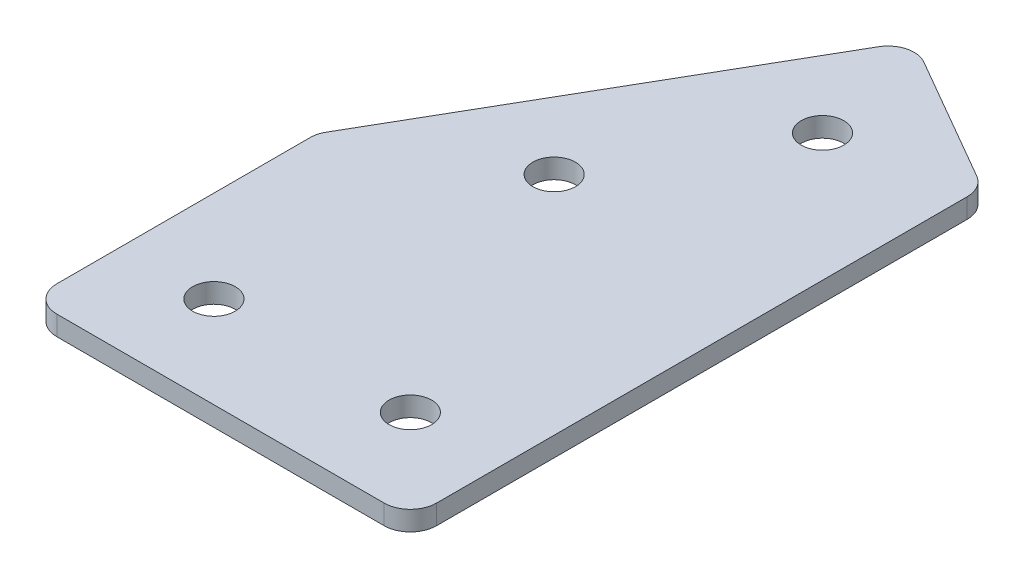
ISO-10303-21;
HEADER;
FILE_DESCRIPTION(('STEP AP214'),'2;1');
FILE_NAME('part.step','',(''),(''),'','','');
FILE_SCHEMA(('AUTOMOTIVE_DESIGN { 1 0 10303 214 1 1 1 1 }'));
ENDSEC;
DATA;
#1=APPLICATION_CONTEXT('core data for automotive mechanical design processes');
#2=APPLICATION_PROTOCOL_DEFINITION('international standard','automotive_design',2000,#1);
#3=PRODUCT_CONTEXT('',#1,'mechanical');
#4=PRODUCT('Part','Part','',(#3));
#5=PRODUCT_RELATED_PRODUCT_CATEGORY('part','',(#4));
#6=PRODUCT_DEFINITION_FORMATION('','',#4);
#7=PRODUCT_DEFINITION_CONTEXT('part definition',#1,'design');
#8=PRODUCT_DEFINITION('design','',#6,#7);
#9=PRODUCT_DEFINITION_SHAPE('','',#8);
#10=(LENGTH_UNIT() NAMED_UNIT(*) SI_UNIT(.MILLI.,.METRE.));
#11=(NAMED_UNIT(*) PLANE_ANGLE_UNIT() SI_UNIT($,.RADIAN.));
#12=(NAMED_UNIT(*) SI_UNIT($,.STERADIAN.) SOLID_ANGLE_UNIT());
#13=UNCERTAINTY_MEASURE_WITH_UNIT(LENGTH_MEASURE(1.E-05),#10,'distance_accuracy_value','');
#14=(GEOMETRIC_REPRESENTATION_CONTEXT(3) GLOBAL_UNCERTAINTY_ASSIGNED_CONTEXT((#13)) GLOBAL_UNIT_ASSIGNED_CONTEXT((#10,
#11,#12)) REPRESENTATION_CONTEXT('',''));
#15=CARTESIAN_POINT('',(0.,0.,0.));
#16=DIRECTION('',(0.,0.,1.));
#17=DIRECTION('',(1.,0.,0.));
#18=AXIS2_PLACEMENT_3D('',#15,#16,#17);
#19=CARTESIAN_POINT('',(-17.0163268204157,1.95798729371791,17.3320099734962));
#20=DIRECTION('',(0.,1.,0.));
#21=DIRECTION('',(0.,0.,1.));
#22=AXIS2_PLACEMENT_3D('',#19,#20,#21);
#23=PLANE('',#22);
#24=CARTESIAN_POINT('',(5.48367317958992,1.95798729371791,17.3320099734962));
#25=DIRECTION('',(0.,1.,0.));
#26=DIRECTION('',(0.,0.,1.));
#27=AXIS2_PLACEMENT_3D('',#24,#25,#26);
#28=CIRCLE('',#27,1.625);
#29=CARTESIAN_POINT('',(5.48367317958992,1.95798729371791,18.9570099734962));
#30=VERTEX_POINT('',#29);
#31=EDGE_CURVE('E201',#30,#30,#28,.T.);
#32=ORIENTED_EDGE('',*,*,#31,.T.);
#33=EDGE_LOOP('',(#32));
#34=FACE_BOUND('',#33,.T.);
#35=CARTESIAN_POINT('',(2.73848265120657,1.95798729371791,-16.8843237251865));
#36=DIRECTION('',(0.,1.,0.));
#37=DIRECTION('',(0.,0.,1.));
#38=AXIS2_PLACEMENT_3D('',#35,#36,#37);
#39=CIRCLE('',#38,1.625);
#40=CARTESIAN_POINT('',(2.73848265120657,1.95798729371791,-15.2593237251865));
#41=VERTEX_POINT('',#40);
#42=EDGE_CURVE('E195',#41,#41,#39,.T.);
#43=ORIENTED_EDGE('',*,*,#42,.T.);
#44=EDGE_LOOP('',(#43));
#45=FACE_BOUND('',#44,.T.);
#46=CARTESIAN_POINT('',(-4.76151734879343,1.95798729371791,-3.89394266841995));
#47=DIRECTION('',(0.,1.,0.));
#48=DIRECTION('',(0.,0.,1.));
#49=AXIS2_PLACEMENT_3D('',#46,#47,#48);
#50=CIRCLE('',#49,1.62500000000001);
#51=CARTESIAN_POINT('',(-4.76151734879343,1.95798729371791,-2.26894266841994));
#52=VERTEX_POINT('',#51);
#53=EDGE_CURVE('E189',#52,#52,#50,.T.);
#54=ORIENTED_EDGE('',*,*,#53,.T.);
#55=EDGE_LOOP('',(#54));
#56=FACE_BOUND('',#55,.T.);
#57=CARTESIAN_POINT('',(-9.51632682041008,1.95798729371791,17.3320099734962));
#58=DIRECTION('',(0.,1.,0.));
#59=DIRECTION('',(0.,0.,1.));
#60=AXIS2_PLACEMENT_3D('',#57,#58,#59);
#61=CIRCLE('',#60,1.625);
#62=CARTESIAN_POINT('',(-9.51632682041008,1.95798729371791,18.9570099734962));
#63=VERTEX_POINT('',#62);
#64=EDGE_CURVE('E115',#63,#63,#61,.T.);
#65=ORIENTED_EDGE('',*,*,#64,.T.);
#66=EDGE_LOOP('',(#65));
#67=FACE_BOUND('',#66,.T.);
#68=DIRECTION('',(0.,0.,1.));
#69=VECTOR('',#68,1.);
#70=CARTESIAN_POINT('',(-16.5163268204101,1.95798729371791,2.46598456971151));
#71=LINE('',#70,#69);
#72=CARTESIAN_POINT('',(-16.5163268204101,1.95798729371791,3.00188295457375));
#73=VERTEX_POINT('',#72);
#74=CARTESIAN_POINT('',(-16.5163268204101,1.95798729371791,22.3320099734963));
#75=VERTEX_POINT('',#74);
#76=EDGE_CURVE('E182',#73,#75,#71,.T.);
#77=ORIENTED_EDGE('',*,*,#76,.F.);
#78=CARTESIAN_POINT('',(-14.5163268204101,1.95798729371791,3.00188295457375));
#79=DIRECTION('',(0.,1.,0.));
#80=DIRECTION('',(0.,0.,1.));
#81=AXIS2_PLACEMENT_3D('',#78,#79,#80);
#82=CIRCLE('',#81,2.);
#83=CARTESIAN_POINT('',(-16.248377627979,1.95798729371791,2.00188295457376));
#84=VERTEX_POINT('',#83);
#85=EDGE_CURVE('E146',#73,#84,#82,.F.);
#86=ORIENTED_EDGE('',*,*,#85,.T.);
#87=DIRECTION('',(-0.500000000000001,0.,0.866025403784438));
#88=VECTOR('',#87,1.);
#89=CARTESIAN_POINT('',(0.176304824715319,1.95798729371791,-26.4465015516776));
#90=LINE('',#89,#88);
#91=CARTESIAN_POINT('',(-0.823695175284678,1.95798729371791,-24.7144507441088));
#92=VERTEX_POINT('',#91);
#93=EDGE_CURVE('E174',#92,#84,#90,.T.);
#94=ORIENTED_EDGE('',*,*,#93,.F.);
#95=CARTESIAN_POINT('',(0.908355632284197,1.95798729371791,-23.7144507441088));
#96=DIRECTION('',(0.,1.,0.));
#97=DIRECTION('',(0.,0.,1.));
#98=AXIS2_PLACEMENT_3D('',#95,#96,#97);
#99=CIRCLE('',#98,2.);
#100=CARTESIAN_POINT('',(1.90835563228419,1.95798729371791,-25.4465015516777));
#101=VERTEX_POINT('',#100);
#102=EDGE_CURVE('E118',#92,#101,#99,.F.);
#103=ORIENTED_EDGE('',*,*,#102,.T.);
#104=DIRECTION('',(-0.86602540378444,0.,-0.499999999999997));
#105=VECTOR('',#104,1.);
#106=CARTESIAN_POINT('',(12.4836731795899,1.95798729371791,-19.340839118975));
#107=LINE('',#106,#105);
#108=CARTESIAN_POINT('',(11.4836731795899,1.95798729371791,-19.9181893881646));
#109=VERTEX_POINT('',#108);
#110=EDGE_CURVE('E119',#109,#101,#107,.T.);
#111=ORIENTED_EDGE('',*,*,#110,.F.);
#112=CARTESIAN_POINT('',(10.4836731795899,1.95798729371791,-18.1861385805957));
#113=DIRECTION('',(0.,1.,0.));
#114=DIRECTION('',(0.,0.,1.));
#115=AXIS2_PLACEMENT_3D('',#112,#113,#114);
#116=CIRCLE('',#115,2.);
#117=CARTESIAN_POINT('',(12.4836731795899,1.95798729371791,-18.1861385805957));
#118=VERTEX_POINT('',#117);
#119=EDGE_CURVE('E141',#109,#118,#116,.F.);
#120=ORIENTED_EDGE('',*,*,#119,.T.);
#121=DIRECTION('',(0.,0.,-1.));
#122=VECTOR('',#121,1.);
#123=CARTESIAN_POINT('',(12.4836731795899,1.95798729371791,24.3320099734963));
#124=LINE('',#123,#122);
#125=CARTESIAN_POINT('',(12.4836731795899,1.95798729371791,22.3320099734963));
#126=VERTEX_POINT('',#125);
#127=EDGE_CURVE('E123',#126,#118,#124,.T.);
#128=ORIENTED_EDGE('',*,*,#127,.F.);
#129=CARTESIAN_POINT('',(10.4836731795899,1.95798729371791,22.3320099734963));
#130=DIRECTION('',(0.,1.,0.));
#131=DIRECTION('',(0.,0.,1.));
#132=AXIS2_PLACEMENT_3D('',#129,#130,#131);
#133=CIRCLE('',#132,2.);
#134=CARTESIAN_POINT('',(10.4836731795899,1.95798729371791,24.3320099734963));
#135=VERTEX_POINT('',#134);
#136=EDGE_CURVE('E31',#126,#135,#133,.F.);
#137=ORIENTED_EDGE('',*,*,#136,.T.);
#138=DIRECTION('',(1.,0.,0.));
#139=VECTOR('',#138,1.);
#140=CARTESIAN_POINT('',(-16.5163268204101,1.95798729371791,24.3320099734963));
#141=LINE('',#140,#139);
#142=CARTESIAN_POINT('',(-14.5163268204101,1.95798729371791,24.3320099734963));
#143=VERTEX_POINT('',#142);
#144=EDGE_CURVE('E180',#143,#135,#141,.T.);
#145=ORIENTED_EDGE('',*,*,#144,.F.);
#146=CARTESIAN_POINT('',(-14.5163268204101,1.95798729371791,22.3320099734963));
#147=DIRECTION('',(0.,1.,0.));
#148=DIRECTION('',(0.,0.,1.));
#149=AXIS2_PLACEMENT_3D('',#146,#147,#148);
#150=CIRCLE('',#149,2.);
#151=EDGE_CURVE('E144',#143,#75,#150,.F.);
#152=ORIENTED_EDGE('',*,*,#151,.T.);
#153=EDGE_LOOP('',(#77,#86,#94,#103,#111,#120,#128,#137,#145,#152));
#154=FACE_BOUND('',#153,.T.);
#155=ADVANCED_FACE('F16',(#34,#45,#56,#67,#154),#23,.F.);
#156=CARTESIAN_POINT('',(0.176304824715319,1.95798729371791,-26.4465015516776));
#157=DIRECTION('',(-0.866025403784438,0.,-0.500000000000001));
#158=DIRECTION('',(-0.500000000000001,0.,0.866025403784438));
#159=AXIS2_PLACEMENT_3D('',#156,#157,#158);
#160=PLANE('',#159);
#161=ORIENTED_EDGE('',*,*,#93,.T.);
#162=DIRECTION('',(0.,1.,0.));
#163=VECTOR('',#162,1.);
#164=CARTESIAN_POINT('',(-16.248377627979,1.95798729371791,2.00188295457375));
#165=LINE('',#164,#163);
#166=CARTESIAN_POINT('',(-16.248377627979,3.45798729371791,2.00188295457376));
#167=VERTEX_POINT('',#166);
#168=EDGE_CURVE('E105',#84,#167,#165,.T.);
#169=ORIENTED_EDGE('',*,*,#168,.T.);
#170=DIRECTION('',(-0.500000000000001,0.,0.866025403784438));
#171=VECTOR('',#170,1.);
#172=CARTESIAN_POINT('',(0.176304824715319,3.45798729371791,-26.4465015516776));
#173=LINE('',#172,#171);
#174=CARTESIAN_POINT('',(-0.823695175284678,3.45798729371791,-24.7144507441088));
#175=VERTEX_POINT('',#174);
#176=EDGE_CURVE('E97',#175,#167,#173,.T.);
#177=ORIENTED_EDGE('',*,*,#176,.F.);
#178=DIRECTION('',(0.,1.,0.));
#179=VECTOR('',#178,1.);
#180=CARTESIAN_POINT('',(-0.823695175284678,1.95798729371791,-24.7144507441088));
#181=LINE('',#180,#179);
#182=EDGE_CURVE('E111',#175,#92,#181,.F.);
#183=ORIENTED_EDGE('',*,*,#182,.T.);
#184=EDGE_LOOP('',(#161,#169,#177,#183));
#185=FACE_BOUND('',#184,.T.);
#186=ADVANCED_FACE('F110',(#185),#160,.T.);
#187=CARTESIAN_POINT('',(12.4836731795899,1.95798729371791,-19.340839118975));
#188=DIRECTION('',(0.499999999999997,0.,-0.866025403784441));
#189=DIRECTION('',(-0.866025403784441,0.,-0.499999999999997));
#190=AXIS2_PLACEMENT_3D('',#187,#188,#189);
#191=PLANE('',#190);
#192=DIRECTION('',(-0.86602540378444,0.,-0.499999999999997));
#193=VECTOR('',#192,1.);
#194=CARTESIAN_POINT('',(12.4836731795899,3.45798729371791,-19.340839118975));
#195=LINE('',#194,#193);
#196=CARTESIAN_POINT('',(11.4836731795899,3.45798729371791,-19.9181893881646));
#197=VERTEX_POINT('',#196);
#198=CARTESIAN_POINT('',(1.90835563228419,3.45798729371791,-25.4465015516777));
#199=VERTEX_POINT('',#198);
#200=EDGE_CURVE('E99',#197,#199,#195,.T.);
#201=ORIENTED_EDGE('',*,*,#200,.F.);
#202=DIRECTION('',(0.,1.,0.));
#203=VECTOR('',#202,1.);
#204=CARTESIAN_POINT('',(11.4836731795899,1.95798729371791,-19.9181893881646));
#205=LINE('',#204,#203);
#206=EDGE_CURVE('E10',#197,#109,#205,.F.);
#207=ORIENTED_EDGE('',*,*,#206,.T.);
#208=ORIENTED_EDGE('',*,*,#110,.T.);
#209=DIRECTION('',(0.,1.,0.));
#210=VECTOR('',#209,1.);
#211=CARTESIAN_POINT('',(1.90835563228419,1.95798729371791,-25.4465015516777));
#212=LINE('',#211,#210);
#213=EDGE_CURVE('E24',#101,#199,#212,.T.);
#214=ORIENTED_EDGE('',*,*,#213,.T.);
#215=EDGE_LOOP('',(#201,#207,#208,#214));
#216=FACE_BOUND('',#215,.T.);
#217=ADVANCED_FACE('F157',(#216),#191,.T.);
#218=CARTESIAN_POINT('',(12.4836731795899,1.95798729371791,24.3320099734963));
#219=DIRECTION('',(1.,0.,0.));
#220=DIRECTION('',(0.,0.,-1.));
#221=AXIS2_PLACEMENT_3D('',#218,#219,#220);
#222=PLANE('',#221);
#223=DIRECTION('',(0.,0.,-1.));
#224=VECTOR('',#223,1.);
#225=CARTESIAN_POINT('',(12.4836731795899,3.45798729371791,24.3320099734963));
#226=LINE('',#225,#224);
#227=CARTESIAN_POINT('',(12.4836731795899,3.45798729371791,22.3320099734963));
#228=VERTEX_POINT('',#227);
#229=CARTESIAN_POINT('',(12.4836731795899,3.45798729371791,-18.1861385805957));
#230=VERTEX_POINT('',#229);
#231=EDGE_CURVE('E170',#228,#230,#226,.T.);
#232=ORIENTED_EDGE('',*,*,#231,.F.);
#233=DIRECTION('',(0.,1.,0.));
#234=VECTOR('',#233,1.);
#235=CARTESIAN_POINT('',(12.4836731795899,1.95798729371791,22.3320099734963));
#236=LINE('',#235,#234);
#237=EDGE_CURVE('E155',#228,#126,#236,.F.);
#238=ORIENTED_EDGE('',*,*,#237,.T.);
#239=ORIENTED_EDGE('',*,*,#127,.T.);
#240=DIRECTION('',(0.,1.,0.));
#241=VECTOR('',#240,1.);
#242=CARTESIAN_POINT('',(12.4836731795899,1.95798729371791,-18.1861385805957));
#243=LINE('',#242,#241);
#244=EDGE_CURVE('E152',#118,#230,#243,.T.);
#245=ORIENTED_EDGE('',*,*,#244,.T.);
#246=EDGE_LOOP('',(#232,#238,#239,#245));
#247=FACE_BOUND('',#246,.T.);
#248=ADVANCED_FACE('F169',(#247),#222,.T.);
#249=CARTESIAN_POINT('',(-16.5163268204101,1.95798729371791,24.3320099734963));
#250=DIRECTION('',(0.,0.,1.));
#251=DIRECTION('',(1.,0.,0.));
#252=AXIS2_PLACEMENT_3D('',#249,#250,#251);
#253=PLANE('',#252);
#254=DIRECTION('',(1.,0.,0.));
#255=VECTOR('',#254,1.);
#256=CARTESIAN_POINT('',(-16.5163268204101,3.45798729371791,24.3320099734963));
#257=LINE('',#256,#255);
#258=CARTESIAN_POINT('',(-14.5163268204101,3.45798729371791,24.3320099734963));
#259=VERTEX_POINT('',#258);
#260=CARTESIAN_POINT('',(10.4836731795899,3.45798729371791,24.3320099734963));
#261=VERTEX_POINT('',#260);
#262=EDGE_CURVE('E173',#259,#261,#257,.T.);
#263=ORIENTED_EDGE('',*,*,#262,.F.);
#264=DIRECTION('',(0.,1.,0.));
#265=VECTOR('',#264,1.);
#266=CARTESIAN_POINT('',(-14.5163268204101,1.95798729371791,24.3320099734963));
#267=LINE('',#266,#265);
#268=EDGE_CURVE('E38',#259,#143,#267,.F.);
#269=ORIENTED_EDGE('',*,*,#268,.T.);
#270=ORIENTED_EDGE('',*,*,#144,.T.);
#271=DIRECTION('',(0.,1.,0.));
#272=VECTOR('',#271,1.);
#273=CARTESIAN_POINT('',(10.4836731795899,1.95798729371791,24.3320099734963));
#274=LINE('',#273,#272);
#275=EDGE_CURVE('E148',#135,#261,#274,.T.);
#276=ORIENTED_EDGE('',*,*,#275,.T.);
#277=EDGE_LOOP('',(#263,#269,#270,#276));
#278=FACE_BOUND('',#277,.T.);
#279=ADVANCED_FACE('F333',(#278),#253,.T.);
#280=CARTESIAN_POINT('',(-16.5163268204101,1.95798729371791,2.46598456971151));
#281=DIRECTION('',(-1.,0.,0.));
#282=DIRECTION('',(0.,0.,1.));
#283=AXIS2_PLACEMENT_3D('',#280,#281,#282);
#284=PLANE('',#283);
#285=DIRECTION('',(0.,0.,1.));
#286=VECTOR('',#285,1.);
#287=CARTESIAN_POINT('',(-16.5163268204101,3.45798729371791,2.46598456971151));
#288=LINE('',#287,#286);
#289=CARTESIAN_POINT('',(-16.5163268204101,3.45798729371791,3.00188295457375));
#290=VERTEX_POINT('',#289);
#291=CARTESIAN_POINT('',(-16.5163268204101,3.45798729371791,22.3320099734963));
#292=VERTEX_POINT('',#291);
#293=EDGE_CURVE('E114',#290,#292,#288,.T.);
#294=ORIENTED_EDGE('',*,*,#293,.F.);
#295=DIRECTION('',(0.,1.,0.));
#296=VECTOR('',#295,1.);
#297=CARTESIAN_POINT('',(-16.5163268204101,1.95798729371791,3.00188295457375));
#298=LINE('',#297,#296);
#299=EDGE_CURVE('E138',#290,#73,#298,.F.);
#300=ORIENTED_EDGE('',*,*,#299,.T.);
#301=ORIENTED_EDGE('',*,*,#76,.T.);
#302=DIRECTION('',(0.,1.,0.));
#303=VECTOR('',#302,1.);
#304=CARTESIAN_POINT('',(-16.5163268204101,1.95798729371791,22.3320099734963));
#305=LINE('',#304,#303);
#306=EDGE_CURVE('E135',#75,#292,#305,.T.);
#307=ORIENTED_EDGE('',*,*,#306,.T.);
#308=EDGE_LOOP('',(#294,#300,#301,#307));
#309=FACE_BOUND('',#308,.T.);
#310=ADVANCED_FACE('F223',(#309),#284,.T.);
#311=CARTESIAN_POINT('',(-17.0163268204157,3.45798729371791,17.3320099734962));
#312=DIRECTION('',(0.,1.,0.));
#313=DIRECTION('',(0.,0.,1.));
#314=AXIS2_PLACEMENT_3D('',#311,#312,#313);
#315=PLANE('',#314);
#316=CARTESIAN_POINT('',(5.48367317958992,3.45798729371791,17.3320099734962));
#317=DIRECTION('',(0.,1.,0.));
#318=DIRECTION('',(0.,0.,1.));
#319=AXIS2_PLACEMENT_3D('',#316,#317,#318);
#320=CIRCLE('',#319,1.625);
#321=CARTESIAN_POINT('',(5.48367317958992,3.45798729371791,18.9570099734962));
#322=VERTEX_POINT('',#321);
#323=EDGE_CURVE('E204',#322,#322,#320,.T.);
#324=ORIENTED_EDGE('',*,*,#323,.F.);
#325=EDGE_LOOP('',(#324));
#326=FACE_BOUND('',#325,.T.);
#327=CARTESIAN_POINT('',(2.73848265120657,3.45798729371791,-16.8843237251865));
#328=DIRECTION('',(0.,1.,0.));
#329=DIRECTION('',(0.,0.,1.));
#330=AXIS2_PLACEMENT_3D('',#327,#328,#329);
#331=CIRCLE('',#330,1.625);
#332=CARTESIAN_POINT('',(2.73848265120657,3.45798729371791,-15.2593237251865));
#333=VERTEX_POINT('',#332);
#334=EDGE_CURVE('E198',#333,#333,#331,.T.);
#335=ORIENTED_EDGE('',*,*,#334,.F.);
#336=EDGE_LOOP('',(#335));
#337=FACE_BOUND('',#336,.T.);
#338=CARTESIAN_POINT('',(-4.76151734879343,3.45798729371791,-3.89394266841995));
#339=DIRECTION('',(0.,1.,0.));
#340=DIRECTION('',(0.,0.,1.));
#341=AXIS2_PLACEMENT_3D('',#338,#339,#340);
#342=CIRCLE('',#341,1.62500000000001);
#343=CARTESIAN_POINT('',(-4.76151734879343,3.45798729371791,-2.26894266841994));
#344=VERTEX_POINT('',#343);
#345=EDGE_CURVE('E192',#344,#344,#342,.T.);
#346=ORIENTED_EDGE('',*,*,#345,.F.);
#347=EDGE_LOOP('',(#346));
#348=FACE_BOUND('',#347,.T.);
#349=CARTESIAN_POINT('',(-9.51632682041008,3.45798729371791,17.3320099734962));
#350=DIRECTION('',(0.,1.,0.));
#351=DIRECTION('',(0.,0.,1.));
#352=AXIS2_PLACEMENT_3D('',#349,#350,#351);
#353=CIRCLE('',#352,1.625);
#354=CARTESIAN_POINT('',(-9.51632682041008,3.45798729371791,18.9570099734962));
#355=VERTEX_POINT('',#354);
#356=EDGE_CURVE('E186',#355,#355,#353,.T.);
#357=ORIENTED_EDGE('',*,*,#356,.F.);
#358=EDGE_LOOP('',(#357));
#359=FACE_BOUND('',#358,.T.);
#360=ORIENTED_EDGE('',*,*,#176,.T.);
#361=CARTESIAN_POINT('',(-14.5163268204101,3.45798729371791,3.00188295457375));
#362=DIRECTION('',(0.,1.,0.));
#363=DIRECTION('',(0.,0.,1.));
#364=AXIS2_PLACEMENT_3D('',#361,#362,#363);
#365=CIRCLE('',#364,2.);
#366=EDGE_CURVE('E133',#167,#290,#365,.T.);
#367=ORIENTED_EDGE('',*,*,#366,.T.);
#368=ORIENTED_EDGE('',*,*,#293,.T.);
#369=CARTESIAN_POINT('',(-14.5163268204101,3.45798729371791,22.3320099734963));
#370=DIRECTION('',(0.,1.,0.));
#371=DIRECTION('',(0.,0.,1.));
#372=AXIS2_PLACEMENT_3D('',#369,#370,#371);
#373=CIRCLE('',#372,2.);
#374=EDGE_CURVE('E131',#292,#259,#373,.T.);
#375=ORIENTED_EDGE('',*,*,#374,.T.);
#376=ORIENTED_EDGE('',*,*,#262,.T.);
#377=CARTESIAN_POINT('',(10.4836731795899,3.45798729371791,22.3320099734963));
#378=DIRECTION('',(0.,1.,0.));
#379=DIRECTION('',(0.,0.,1.));
#380=AXIS2_PLACEMENT_3D('',#377,#378,#379);
#381=CIRCLE('',#380,2.);
#382=EDGE_CURVE('E129',#261,#228,#381,.T.);
#383=ORIENTED_EDGE('',*,*,#382,.T.);
#384=ORIENTED_EDGE('',*,*,#231,.T.);
#385=CARTESIAN_POINT('',(10.4836731795899,3.45798729371791,-18.1861385805957));
#386=DIRECTION('',(0.,1.,0.));
#387=DIRECTION('',(0.,0.,1.));
#388=AXIS2_PLACEMENT_3D('',#385,#386,#387);
#389=CIRCLE('',#388,2.);
#390=EDGE_CURVE('E104',#230,#197,#389,.T.);
#391=ORIENTED_EDGE('',*,*,#390,.T.);
#392=ORIENTED_EDGE('',*,*,#200,.T.);
#393=CARTESIAN_POINT('',(0.908355632284197,3.45798729371791,-23.7144507441088));
#394=DIRECTION('',(0.,1.,0.));
#395=DIRECTION('',(0.,0.,1.));
#396=AXIS2_PLACEMENT_3D('',#393,#394,#395);
#397=CIRCLE('',#396,2.);
#398=EDGE_CURVE('E94',#199,#175,#397,.T.);
#399=ORIENTED_EDGE('',*,*,#398,.T.);
#400=EDGE_LOOP('',(#360,#367,#368,#375,#376,#383,#384,#391,#392,#399));
#401=FACE_BOUND('',#400,.T.);
#402=ADVANCED_FACE('F96',(#326,#337,#348,#359,#401),#315,.T.);
#403=CARTESIAN_POINT('',(-9.51632682041008,1.95798729371791,17.3320099734962));
#404=DIRECTION('',(0.,1.,0.));
#405=DIRECTION('',(0.,0.,1.));
#406=AXIS2_PLACEMENT_3D('',#403,#404,#405);
#407=CYLINDRICAL_SURFACE('',#406,1.625);
#408=ORIENTED_EDGE('',*,*,#64,.F.);
#409=EDGE_LOOP('',(#408));
#410=FACE_BOUND('',#409,.T.);
#411=ORIENTED_EDGE('',*,*,#356,.T.);
#412=EDGE_LOOP('',(#411));
#413=FACE_BOUND('',#412,.T.);
#414=ADVANCED_FACE('F222',(#410,#413),#407,.F.);
#415=CARTESIAN_POINT('',(-4.76151734879343,1.95798729371791,-3.89394266841995));
#416=DIRECTION('',(0.,1.,0.));
#417=DIRECTION('',(0.,0.,1.));
#418=AXIS2_PLACEMENT_3D('',#415,#416,#417);
#419=CYLINDRICAL_SURFACE('',#418,1.62500000000001);
#420=ORIENTED_EDGE('',*,*,#53,.F.);
#421=EDGE_LOOP('',(#420));
#422=FACE_BOUND('',#421,.T.);
#423=ORIENTED_EDGE('',*,*,#345,.T.);
#424=EDGE_LOOP('',(#423));
#425=FACE_BOUND('',#424,.T.);
#426=ADVANCED_FACE('F232',(#422,#425),#419,.F.);
#427=CARTESIAN_POINT('',(2.73848265120657,1.95798729371791,-16.8843237251865));
#428=DIRECTION('',(0.,1.,0.));
#429=DIRECTION('',(0.,0.,1.));
#430=AXIS2_PLACEMENT_3D('',#427,#428,#429);
#431=CYLINDRICAL_SURFACE('',#430,1.625);
#432=ORIENTED_EDGE('',*,*,#42,.F.);
#433=EDGE_LOOP('',(#432));
#434=FACE_BOUND('',#433,.T.);
#435=ORIENTED_EDGE('',*,*,#334,.T.);
#436=EDGE_LOOP('',(#435));
#437=FACE_BOUND('',#436,.T.);
#438=ADVANCED_FACE('F216',(#434,#437),#431,.F.);
#439=CARTESIAN_POINT('',(5.48367317958992,1.95798729371791,17.3320099734962));
#440=DIRECTION('',(0.,1.,0.));
#441=DIRECTION('',(0.,0.,1.));
#442=AXIS2_PLACEMENT_3D('',#439,#440,#441);
#443=CYLINDRICAL_SURFACE('',#442,1.625);
#444=ORIENTED_EDGE('',*,*,#31,.F.);
#445=EDGE_LOOP('',(#444));
#446=FACE_BOUND('',#445,.T.);
#447=ORIENTED_EDGE('',*,*,#323,.T.);
#448=EDGE_LOOP('',(#447));
#449=FACE_BOUND('',#448,.T.);
#450=ADVANCED_FACE('F212',(#446,#449),#443,.F.);
#451=CARTESIAN_POINT('',(-14.5163268204101,1.95798729371791,3.00188295457375));
#452=DIRECTION('',(0.,1.,0.));
#453=DIRECTION('',(0.,0.,1.));
#454=AXIS2_PLACEMENT_3D('',#451,#452,#453);
#455=CYLINDRICAL_SURFACE('',#454,2.);
#456=ORIENTED_EDGE('',*,*,#85,.F.);
#457=ORIENTED_EDGE('',*,*,#299,.F.);
#458=ORIENTED_EDGE('',*,*,#366,.F.);
#459=ORIENTED_EDGE('',*,*,#168,.F.);
#460=EDGE_LOOP('',(#456,#457,#458,#459));
#461=FACE_BOUND('',#460,.T.);
#462=ADVANCED_FACE('F215',(#461),#455,.T.);
#463=CARTESIAN_POINT('',(-14.5163268204101,1.95798729371791,22.3320099734963));
#464=DIRECTION('',(0.,1.,0.));
#465=DIRECTION('',(0.,0.,1.));
#466=AXIS2_PLACEMENT_3D('',#463,#464,#465);
#467=CYLINDRICAL_SURFACE('',#466,2.);
#468=ORIENTED_EDGE('',*,*,#151,.F.);
#469=ORIENTED_EDGE('',*,*,#268,.F.);
#470=ORIENTED_EDGE('',*,*,#374,.F.);
#471=ORIENTED_EDGE('',*,*,#306,.F.);
#472=EDGE_LOOP('',(#468,#469,#470,#471));
#473=FACE_BOUND('',#472,.T.);
#474=ADVANCED_FACE('F252',(#473),#467,.T.);
#475=CARTESIAN_POINT('',(10.4836731795899,1.95798729371791,22.3320099734963));
#476=DIRECTION('',(0.,1.,0.));
#477=DIRECTION('',(0.,0.,1.));
#478=AXIS2_PLACEMENT_3D('',#475,#476,#477);
#479=CYLINDRICAL_SURFACE('',#478,2.);
#480=ORIENTED_EDGE('',*,*,#136,.F.);
#481=ORIENTED_EDGE('',*,*,#237,.F.);
#482=ORIENTED_EDGE('',*,*,#382,.F.);
#483=ORIENTED_EDGE('',*,*,#275,.F.);
#484=EDGE_LOOP('',(#480,#481,#482,#483));
#485=FACE_BOUND('',#484,.T.);
#486=ADVANCED_FACE('F256',(#485),#479,.T.);
#487=CARTESIAN_POINT('',(10.4836731795899,1.95798729371791,-18.1861385805957));
#488=DIRECTION('',(0.,1.,0.));
#489=DIRECTION('',(0.,0.,1.));
#490=AXIS2_PLACEMENT_3D('',#487,#488,#489);
#491=CYLINDRICAL_SURFACE('',#490,2.);
#492=ORIENTED_EDGE('',*,*,#119,.F.);
#493=ORIENTED_EDGE('',*,*,#206,.F.);
#494=ORIENTED_EDGE('',*,*,#390,.F.);
#495=ORIENTED_EDGE('',*,*,#244,.F.);
#496=EDGE_LOOP('',(#492,#493,#494,#495));
#497=FACE_BOUND('',#496,.T.);
#498=ADVANCED_FACE('F165',(#497),#491,.T.);
#499=CARTESIAN_POINT('',(0.908355632284197,1.95798729371791,-23.7144507441088));
#500=DIRECTION('',(0.,1.,0.));
#501=DIRECTION('',(0.,0.,1.));
#502=AXIS2_PLACEMENT_3D('',#499,#500,#501);
#503=CYLINDRICAL_SURFACE('',#502,2.);
#504=ORIENTED_EDGE('',*,*,#102,.F.);
#505=ORIENTED_EDGE('',*,*,#182,.F.);
#506=ORIENTED_EDGE('',*,*,#398,.F.);
#507=ORIENTED_EDGE('',*,*,#213,.F.);
#508=EDGE_LOOP('',(#504,#505,#506,#507));
#509=FACE_BOUND('',#508,.T.);
#510=ADVANCED_FACE('F18',(#509),#503,.T.);
#511=CLOSED_SHELL('',(#155,#186,#217,#248,#279,#310,#402,#414,#426,#438,#450,#462,#474,#486,
#498,#510));
#512=MANIFOLD_SOLID_BREP('B1',#511);
#513=ADVANCED_BREP_SHAPE_REPRESENTATION('',(#18,#512),#14);
#514=SHAPE_DEFINITION_REPRESENTATION(#9,#513);
ENDSEC;
END-ISO-10303-21;
